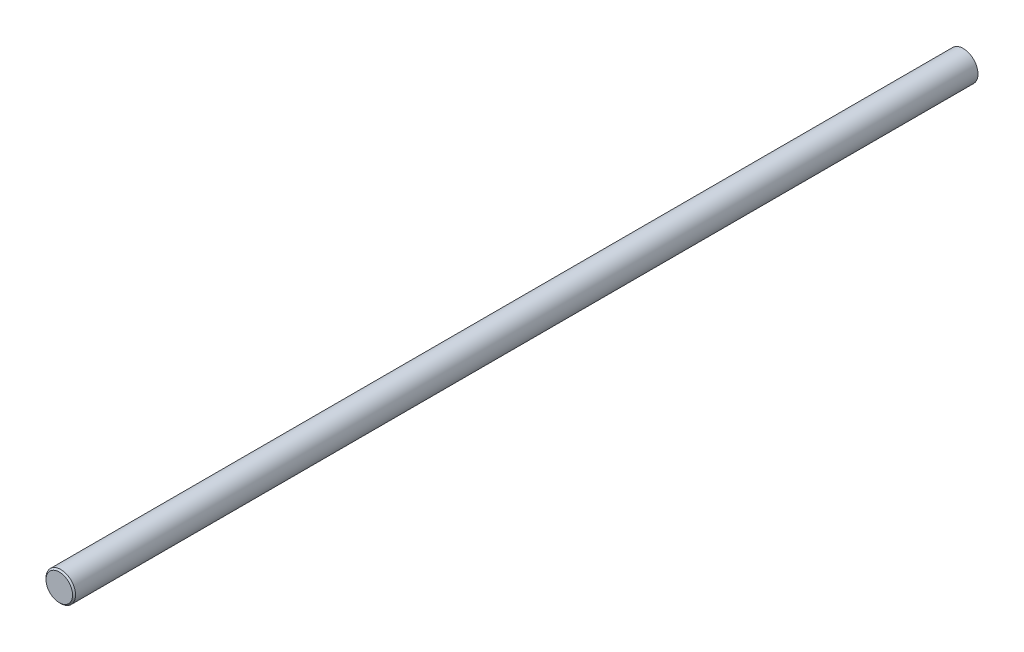
ISO-10303-21;
HEADER;
FILE_DESCRIPTION(('STEP AP214'),'2;1');
FILE_NAME('part.step','',(''),(''),'','','');
FILE_SCHEMA(('AUTOMOTIVE_DESIGN { 1 0 10303 214 1 1 1 1 }'));
ENDSEC;
DATA;
#1=APPLICATION_CONTEXT('core data for automotive mechanical design processes');
#2=APPLICATION_PROTOCOL_DEFINITION('international standard','automotive_design',2000,#1);
#3=PRODUCT_CONTEXT('',#1,'mechanical');
#4=PRODUCT('Part','Part','',(#3));
#5=PRODUCT_RELATED_PRODUCT_CATEGORY('part','',(#4));
#6=PRODUCT_DEFINITION_FORMATION('','',#4);
#7=PRODUCT_DEFINITION_CONTEXT('part definition',#1,'design');
#8=PRODUCT_DEFINITION('design','',#6,#7);
#9=PRODUCT_DEFINITION_SHAPE('','',#8);
#10=(LENGTH_UNIT() NAMED_UNIT(*) SI_UNIT(.MILLI.,.METRE.));
#11=(NAMED_UNIT(*) PLANE_ANGLE_UNIT() SI_UNIT($,.RADIAN.));
#12=(NAMED_UNIT(*) SI_UNIT($,.STERADIAN.) SOLID_ANGLE_UNIT());
#13=UNCERTAINTY_MEASURE_WITH_UNIT(LENGTH_MEASURE(1.E-05),#10,'distance_accuracy_value','');
#14=(GEOMETRIC_REPRESENTATION_CONTEXT(3) GLOBAL_UNCERTAINTY_ASSIGNED_CONTEXT((#13)) GLOBAL_UNIT_ASSIGNED_CONTEXT((#10,
#11,#12)) REPRESENTATION_CONTEXT('',''));
#15=CARTESIAN_POINT('',(0.,0.,0.));
#16=DIRECTION('',(0.,0.,1.));
#17=DIRECTION('',(1.,0.,0.));
#18=AXIS2_PLACEMENT_3D('',#15,#16,#17);
#19=CARTESIAN_POINT('',(0.,0.,1001.5875));
#20=DIRECTION('',(0.,0.,1.));
#21=DIRECTION('',(1.,0.,0.));
#22=AXIS2_PLACEMENT_3D('',#19,#20,#21);
#23=PLANE('',#22);
#24=CARTESIAN_POINT('',(0.,0.,1001.5875));
#25=DIRECTION('',(0.,0.,1.));
#26=DIRECTION('',(1.,0.,0.));
#27=AXIS2_PLACEMENT_3D('',#24,#25,#26);
#28=CIRCLE('',#27,15.48);
#29=CARTESIAN_POINT('',(15.48,0.,1001.5875));
#30=VERTEX_POINT('',#29);
#31=EDGE_CURVE('E18',#30,#30,#28,.F.);
#32=ORIENTED_EDGE('',*,*,#31,.T.);
#33=EDGE_LOOP('',(#32));
#34=FACE_BOUND('',#33,.T.);
#35=ADVANCED_FACE('F15',(#34),#23,.F.);
#36=CARTESIAN_POINT('',(0.,0.,0.));
#37=DIRECTION('',(0.,0.,1.));
#38=DIRECTION('',(1.,0.,0.));
#39=AXIS2_PLACEMENT_3D('',#36,#37,#38);
#40=CYLINDRICAL_SURFACE('',#39,15.48);
#41=CARTESIAN_POINT('',(0.,0.,0.));
#42=DIRECTION('',(0.,0.,1.));
#43=DIRECTION('',(1.,0.,0.));
#44=AXIS2_PLACEMENT_3D('',#41,#42,#43);
#45=CIRCLE('',#44,15.48);
#46=CARTESIAN_POINT('',(15.48,0.,0.));
#47=VERTEX_POINT('',#46);
#48=EDGE_CURVE('E31',#47,#47,#45,.F.);
#49=ORIENTED_EDGE('',*,*,#48,.T.);
#50=EDGE_LOOP('',(#49));
#51=FACE_BOUND('',#50,.T.);
#52=ORIENTED_EDGE('',*,*,#31,.F.);
#53=EDGE_LOOP('',(#52));
#54=FACE_BOUND('',#53,.T.);
#55=ADVANCED_FACE('F39',(#51,#54),#40,.F.);
#56=CARTESIAN_POINT('',(0.,15.075,1025.5));
#57=DIRECTION('',(0.,0.,-1.));
#58=DIRECTION('',(-1.,0.,0.));
#59=AXIS2_PLACEMENT_3D('',#56,#57,#58);
#60=PLANE('',#59);
#61=CARTESIAN_POINT('',(0.,0.,1025.5));
#62=DIRECTION('',(0.,0.,-1.));
#63=DIRECTION('',(-1.,0.,0.));
#64=AXIS2_PLACEMENT_3D('',#61,#62,#63);
#65=CIRCLE('',#64,15.075);
#66=CARTESIAN_POINT('',(-15.075,0.,1025.5));
#67=VERTEX_POINT('',#66);
#68=EDGE_CURVE('E27',#67,#67,#65,.T.);
#69=ORIENTED_EDGE('',*,*,#68,.F.);
#70=EDGE_LOOP('',(#69));
#71=FACE_BOUND('',#70,.T.);
#72=ADVANCED_FACE('F41',(#71),#60,.F.);
#73=CARTESIAN_POINT('',(0.,15.48,0.));
#74=DIRECTION('',(0.,0.,1.));
#75=DIRECTION('',(1.,0.,0.));
#76=AXIS2_PLACEMENT_3D('',#73,#74,#75);
#77=PLANE('',#76);
#78=ORIENTED_EDGE('',*,*,#48,.F.);
#79=EDGE_LOOP('',(#78));
#80=FACE_BOUND('',#79,.T.);
#81=CARTESIAN_POINT('',(0.,0.,0.));
#82=DIRECTION('',(0.,0.,1.));
#83=DIRECTION('',(1.,0.,0.));
#84=AXIS2_PLACEMENT_3D('',#81,#82,#83);
#85=CIRCLE('',#84,16.7499999999999);
#86=CARTESIAN_POINT('',(16.7499999999999,0.,0.));
#87=VERTEX_POINT('',#86);
#88=EDGE_CURVE('E22',#87,#87,#85,.T.);
#89=ORIENTED_EDGE('',*,*,#88,.F.);
#90=EDGE_LOOP('',(#89));
#91=FACE_BOUND('',#90,.T.);
#92=ADVANCED_FACE('F47',(#80,#91),#77,.F.);
#93=CARTESIAN_POINT('',(0.,0.,1023.825));
#94=DIRECTION('',(0.,0.,-1.));
#95=DIRECTION('',(-1.,0.,0.));
#96=AXIS2_PLACEMENT_3D('',#93,#94,#95);
#97=CONICAL_SURFACE('',#96,16.7499999999999,0.785398163397523);
#98=CARTESIAN_POINT('',(0.,0.,1023.825));
#99=DIRECTION('',(0.,0.,1.));
#100=DIRECTION('',(1.,0.,0.));
#101=AXIS2_PLACEMENT_3D('',#98,#99,#100);
#102=CIRCLE('',#101,16.7499999999999);
#103=CARTESIAN_POINT('',(16.7499999999999,0.,1023.825));
#104=VERTEX_POINT('',#103);
#105=EDGE_CURVE('E10',#104,#104,#102,.F.);
#106=ORIENTED_EDGE('',*,*,#105,.F.);
#107=EDGE_LOOP('',(#106));
#108=FACE_BOUND('',#107,.T.);
#109=ORIENTED_EDGE('',*,*,#68,.T.);
#110=EDGE_LOOP('',(#109));
#111=FACE_BOUND('',#110,.T.);
#112=ADVANCED_FACE('F52',(#108,#111),#97,.T.);
#113=CARTESIAN_POINT('',(0.,0.,0.));
#114=DIRECTION('',(0.,0.,1.));
#115=DIRECTION('',(1.,0.,0.));
#116=AXIS2_PLACEMENT_3D('',#113,#114,#115);
#117=CYLINDRICAL_SURFACE('',#116,16.7499999999999);
#118=ORIENTED_EDGE('',*,*,#105,.T.);
#119=EDGE_LOOP('',(#118));
#120=FACE_BOUND('',#119,.T.);
#121=ORIENTED_EDGE('',*,*,#88,.T.);
#122=EDGE_LOOP('',(#121));
#123=FACE_BOUND('',#122,.T.);
#124=ADVANCED_FACE('F50',(#120,#123),#117,.T.);
#125=CLOSED_SHELL('',(#35,#55,#72,#92,#112,#124));
#126=MANIFOLD_SOLID_BREP('B1',#125);
#127=ADVANCED_BREP_SHAPE_REPRESENTATION('',(#18,#126),#14);
#128=SHAPE_DEFINITION_REPRESENTATION(#9,#127);
ENDSEC;
END-ISO-10303-21;
